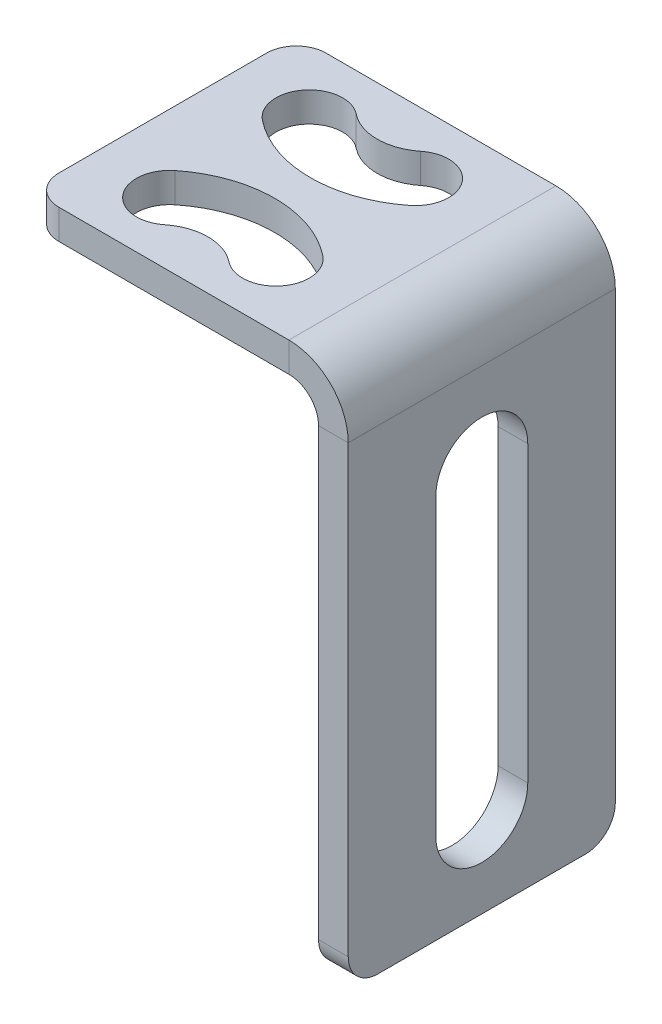
ISO-10303-21;
HEADER;
FILE_DESCRIPTION(('STEP AP214'),'2;1');
FILE_NAME('part.step','',(''),(''),'','','');
FILE_SCHEMA(('AUTOMOTIVE_DESIGN { 1 0 10303 214 1 1 1 1 }'));
ENDSEC;
DATA;
#1=APPLICATION_CONTEXT('core data for automotive mechanical design processes');
#2=APPLICATION_PROTOCOL_DEFINITION('international standard','automotive_design',2000,#1);
#3=PRODUCT_CONTEXT('',#1,'mechanical');
#4=PRODUCT('Part','Part','',(#3));
#5=PRODUCT_RELATED_PRODUCT_CATEGORY('part','',(#4));
#6=PRODUCT_DEFINITION_FORMATION('','',#4);
#7=PRODUCT_DEFINITION_CONTEXT('part definition',#1,'design');
#8=PRODUCT_DEFINITION('design','',#6,#7);
#9=PRODUCT_DEFINITION_SHAPE('','',#8);
#10=(LENGTH_UNIT() NAMED_UNIT(*) SI_UNIT(.MILLI.,.METRE.));
#11=(NAMED_UNIT(*) PLANE_ANGLE_UNIT() SI_UNIT($,.RADIAN.));
#12=(NAMED_UNIT(*) SI_UNIT($,.STERADIAN.) SOLID_ANGLE_UNIT());
#13=UNCERTAINTY_MEASURE_WITH_UNIT(LENGTH_MEASURE(1.E-05),#10,'distance_accuracy_value','');
#14=(GEOMETRIC_REPRESENTATION_CONTEXT(3) GLOBAL_UNCERTAINTY_ASSIGNED_CONTEXT((#13)) GLOBAL_UNIT_ASSIGNED_CONTEXT((#10,
#11,#12)) REPRESENTATION_CONTEXT('',''));
#15=CARTESIAN_POINT('',(0.,0.,0.));
#16=DIRECTION('',(0.,0.,1.));
#17=DIRECTION('',(1.,0.,0.));
#18=AXIS2_PLACEMENT_3D('',#15,#16,#17);
#19=CARTESIAN_POINT('',(0.,-2.,59.9314917454649));
#20=DIRECTION('',(0.,-1.,0.));
#21=DIRECTION('',(1.,0.,0.));
#22=AXIS2_PLACEMENT_3D('',#19,#20,#21);
#23=PLANE('',#22);
#24=CARTESIAN_POINT('',(-12.75,-2.,-0.189186414028294));
#25=DIRECTION('',(0.,-1.,0.));
#26=DIRECTION('',(1.,0.,0.));
#27=AXIS2_PLACEMENT_3D('',#24,#25,#26);
#28=CIRCLE('',#27,3.48876464580081);
#29=CARTESIAN_POINT('',(-14.9233481643761,-2.,2.53992269155772));
#30=VERTEX_POINT('',#29);
#31=CARTESIAN_POINT('',(-10.5766518356239,-2.,2.53992269155772));
#32=VERTEX_POINT('',#31);
#33=EDGE_CURVE('E364',#30,#32,#28,.F.);
#34=ORIENTED_EDGE('',*,*,#33,.F.);
#35=CARTESIAN_POINT('',(-16.325,-2.,4.29999999999967));
#36=DIRECTION('',(0.,-1.,0.));
#37=DIRECTION('',(1.,0.,0.));
#38=AXIS2_PLACEMENT_3D('',#35,#36,#37);
#39=CIRCLE('',#38,2.25);
#40=CARTESIAN_POINT('',(-17.7266518356239,-2.,6.06007730844163));
#41=VERTEX_POINT('',#40);
#42=EDGE_CURVE('E239',#30,#41,#39,.F.);
#43=ORIENTED_EDGE('',*,*,#42,.T.);
#44=CARTESIAN_POINT('',(-12.75,-2.,-0.189186414028294));
#45=DIRECTION('',(0.,-1.,0.));
#46=DIRECTION('',(1.,0.,0.));
#47=AXIS2_PLACEMENT_3D('',#44,#45,#46);
#48=CIRCLE('',#47,7.98876464580081);
#49=CARTESIAN_POINT('',(-7.77334816437615,-2.,6.06007730844163));
#50=VERTEX_POINT('',#49);
#51=EDGE_CURVE('E373',#50,#41,#48,.T.);
#52=ORIENTED_EDGE('',*,*,#51,.F.);
#53=CARTESIAN_POINT('',(-9.175,-2.,4.29999999999967));
#54=DIRECTION('',(0.,-1.,0.));
#55=DIRECTION('',(1.,0.,0.));
#56=AXIS2_PLACEMENT_3D('',#53,#54,#55);
#57=CIRCLE('',#56,2.25);
#58=EDGE_CURVE('E235',#50,#32,#57,.F.);
#59=ORIENTED_EDGE('',*,*,#58,.T.);
#60=EDGE_LOOP('',(#34,#43,#52,#59));
#61=FACE_BOUND('',#60,.T.);
#62=DIRECTION('',(1.,0.,0.));
#63=VECTOR('',#62,1.);
#64=CARTESIAN_POINT('',(0.,-2.,17.9999999999999));
#65=LINE('',#64,#63);
#66=CARTESIAN_POINT('',(-19.5,-2.,17.9999999999999));
#67=VERTEX_POINT('',#66);
#68=CARTESIAN_POINT('',(-4.,-2.,17.9999999999999));
#69=VERTEX_POINT('',#68);
#70=EDGE_CURVE('E257',#67,#69,#65,.T.);
#71=ORIENTED_EDGE('',*,*,#70,.F.);
#72=CARTESIAN_POINT('',(-19.5,-2.,15.9999999999999));
#73=DIRECTION('',(0.,-1.,0.));
#74=DIRECTION('',(1.,0.,0.));
#75=AXIS2_PLACEMENT_3D('',#72,#73,#74);
#76=CIRCLE('',#75,2.);
#77=CARTESIAN_POINT('',(-21.5,-2.,15.9999999999999));
#78=VERTEX_POINT('',#77);
#79=EDGE_CURVE('E336',#67,#78,#76,.T.);
#80=ORIENTED_EDGE('',*,*,#79,.T.);
#81=DIRECTION('',(0.,0.,-1.));
#82=VECTOR('',#81,1.);
#83=CARTESIAN_POINT('',(-21.5,-2.,59.9314917454649));
#84=LINE('',#83,#82);
#85=CARTESIAN_POINT('',(-21.5,-2.,2.));
#86=VERTEX_POINT('',#85);
#87=EDGE_CURVE('E259',#78,#86,#84,.T.);
#88=ORIENTED_EDGE('',*,*,#87,.T.);
#89=CARTESIAN_POINT('',(-19.5,-2.,2.));
#90=DIRECTION('',(0.,-1.,0.));
#91=DIRECTION('',(1.,0.,0.));
#92=AXIS2_PLACEMENT_3D('',#89,#90,#91);
#93=CIRCLE('',#92,2.);
#94=CARTESIAN_POINT('',(-19.5,-2.,0.));
#95=VERTEX_POINT('',#94);
#96=EDGE_CURVE('E334',#86,#95,#93,.T.);
#97=ORIENTED_EDGE('',*,*,#96,.T.);
#98=DIRECTION('',(-1.,0.,0.));
#99=VECTOR('',#98,1.);
#100=CARTESIAN_POINT('',(0.,-2.,0.));
#101=LINE('',#100,#99);
#102=CARTESIAN_POINT('',(-4.,-2.,0.));
#103=VERTEX_POINT('',#102);
#104=EDGE_CURVE('E262',#103,#95,#101,.T.);
#105=ORIENTED_EDGE('',*,*,#104,.F.);
#106=DIRECTION('',(0.,0.,-1.));
#107=VECTOR('',#106,1.);
#108=CARTESIAN_POINT('',(-4.,-2.,17.9999999999999));
#109=LINE('',#108,#107);
#110=EDGE_CURVE('E268',#103,#69,#109,.F.);
#111=ORIENTED_EDGE('',*,*,#110,.T.);
#112=EDGE_LOOP('',(#71,#80,#88,#97,#105,#111));
#113=FACE_BOUND('',#112,.T.);
#114=CARTESIAN_POINT('',(-9.175,-2.,13.7000000000002));
#115=DIRECTION('',(0.,-1.,0.));
#116=DIRECTION('',(1.,0.,0.));
#117=AXIS2_PLACEMENT_3D('',#114,#115,#116);
#118=CIRCLE('',#117,2.25);
#119=CARTESIAN_POINT('',(-7.77334816437614,-2.,11.9399226915583));
#120=VERTEX_POINT('',#119);
#121=CARTESIAN_POINT('',(-10.5766518356239,-2.,15.4600773084422));
#122=VERTEX_POINT('',#121);
#123=EDGE_CURVE('E197',#120,#122,#118,.T.);
#124=ORIENTED_EDGE('',*,*,#123,.F.);
#125=CARTESIAN_POINT('',(-12.75,-2.,18.1891864140282));
#126=DIRECTION('',(0.,-1.,0.));
#127=DIRECTION('',(1.,0.,0.));
#128=AXIS2_PLACEMENT_3D('',#125,#126,#127);
#129=CIRCLE('',#128,7.98876464580081);
#130=CARTESIAN_POINT('',(-17.7266518356239,-2.,11.9399226915583));
#131=VERTEX_POINT('',#130);
#132=EDGE_CURVE('E30',#120,#131,#129,.F.);
#133=ORIENTED_EDGE('',*,*,#132,.T.);
#134=CARTESIAN_POINT('',(-16.325,-2.,13.7000000000002));
#135=DIRECTION('',(0.,-1.,0.));
#136=DIRECTION('',(1.,0.,0.));
#137=AXIS2_PLACEMENT_3D('',#134,#135,#136);
#138=CIRCLE('',#137,2.25);
#139=CARTESIAN_POINT('',(-14.9233481643761,-2.,15.4600773084422));
#140=VERTEX_POINT('',#139);
#141=EDGE_CURVE('E196',#140,#131,#138,.T.);
#142=ORIENTED_EDGE('',*,*,#141,.F.);
#143=CARTESIAN_POINT('',(-12.75,-2.,18.1891864140282));
#144=DIRECTION('',(0.,-1.,0.));
#145=DIRECTION('',(1.,0.,0.));
#146=AXIS2_PLACEMENT_3D('',#143,#144,#145);
#147=CIRCLE('',#146,3.48876464580081);
#148=EDGE_CURVE('E188',#140,#122,#147,.T.);
#149=ORIENTED_EDGE('',*,*,#148,.T.);
#150=EDGE_LOOP('',(#124,#133,#142,#149));
#151=FACE_BOUND('',#150,.T.);
#152=ADVANCED_FACE('F16',(#61,#113,#151),#23,.T.);
#153=CARTESIAN_POINT('',(0.,0.,59.9314917454649));
#154=DIRECTION('',(0.,-1.,0.));
#155=DIRECTION('',(1.,0.,0.));
#156=AXIS2_PLACEMENT_3D('',#153,#154,#155);
#157=PLANE('',#156);
#158=CARTESIAN_POINT('',(-16.325,0.,4.29999999999967));
#159=DIRECTION('',(0.,1.,0.));
#160=DIRECTION('',(-1.,0.,0.));
#161=AXIS2_PLACEMENT_3D('',#158,#159,#160);
#162=CIRCLE('',#161,2.25);
#163=CARTESIAN_POINT('',(-14.9233481643761,0.,2.53992269155772));
#164=VERTEX_POINT('',#163);
#165=CARTESIAN_POINT('',(-17.7266518356239,0.,6.06007730844163));
#166=VERTEX_POINT('',#165);
#167=EDGE_CURVE('E242',#164,#166,#162,.T.);
#168=ORIENTED_EDGE('',*,*,#167,.F.);
#169=CARTESIAN_POINT('',(-12.75,0.,-0.189186414028294));
#170=DIRECTION('',(0.,-1.,0.));
#171=DIRECTION('',(-1.,0.,0.));
#172=AXIS2_PLACEMENT_3D('',#169,#170,#171);
#173=CIRCLE('',#172,3.48876464580081);
#174=CARTESIAN_POINT('',(-10.5766518356239,0.,2.53992269155772));
#175=VERTEX_POINT('',#174);
#176=EDGE_CURVE('E358',#175,#164,#173,.T.);
#177=ORIENTED_EDGE('',*,*,#176,.F.);
#178=CARTESIAN_POINT('',(-9.175,0.,4.29999999999967));
#179=DIRECTION('',(0.,1.,0.));
#180=DIRECTION('',(-1.,0.,0.));
#181=AXIS2_PLACEMENT_3D('',#178,#179,#180);
#182=CIRCLE('',#181,2.25);
#183=CARTESIAN_POINT('',(-7.77334816437615,0.,6.06007730844163));
#184=VERTEX_POINT('',#183);
#185=EDGE_CURVE('E236',#184,#175,#182,.T.);
#186=ORIENTED_EDGE('',*,*,#185,.F.);
#187=CARTESIAN_POINT('',(-12.75,0.,-0.189186414028294));
#188=DIRECTION('',(0.,1.,0.));
#189=DIRECTION('',(-1.,0.,0.));
#190=AXIS2_PLACEMENT_3D('',#187,#188,#189);
#191=CIRCLE('',#190,7.98876464580081);
#192=EDGE_CURVE('E353',#166,#184,#191,.T.);
#193=ORIENTED_EDGE('',*,*,#192,.F.);
#194=EDGE_LOOP('',(#168,#177,#186,#193));
#195=FACE_BOUND('',#194,.T.);
#196=DIRECTION('',(0.,0.,1.));
#197=VECTOR('',#196,1.);
#198=CARTESIAN_POINT('',(-21.5,0.,59.9314917454649));
#199=LINE('',#198,#197);
#200=CARTESIAN_POINT('',(-21.5,0.,15.9999999999999));
#201=VERTEX_POINT('',#200);
#202=CARTESIAN_POINT('',(-21.5,0.,2.));
#203=VERTEX_POINT('',#202);
#204=EDGE_CURVE('E286',#201,#203,#199,.F.);
#205=ORIENTED_EDGE('',*,*,#204,.F.);
#206=CARTESIAN_POINT('',(-19.5,0.,15.9999999999999));
#207=DIRECTION('',(0.,-1.,0.));
#208=DIRECTION('',(1.,0.,0.));
#209=AXIS2_PLACEMENT_3D('',#206,#207,#208);
#210=CIRCLE('',#209,2.);
#211=CARTESIAN_POINT('',(-19.5,0.,17.9999999999999));
#212=VERTEX_POINT('',#211);
#213=EDGE_CURVE('E345',#201,#212,#210,.F.);
#214=ORIENTED_EDGE('',*,*,#213,.T.);
#215=DIRECTION('',(1.,0.,0.));
#216=VECTOR('',#215,1.);
#217=CARTESIAN_POINT('',(0.,0.,17.9999999999999));
#218=LINE('',#217,#216);
#219=CARTESIAN_POINT('',(-4.,0.,17.9999999999999));
#220=VERTEX_POINT('',#219);
#221=EDGE_CURVE('E289',#212,#220,#218,.T.);
#222=ORIENTED_EDGE('',*,*,#221,.T.);
#223=DIRECTION('',(0.,0.,1.));
#224=VECTOR('',#223,1.);
#225=CARTESIAN_POINT('',(-4.,0.,59.9314917454649));
#226=LINE('',#225,#224);
#227=CARTESIAN_POINT('',(-4.,0.,0.));
#228=VERTEX_POINT('',#227);
#229=EDGE_CURVE('E275',#228,#220,#226,.T.);
#230=ORIENTED_EDGE('',*,*,#229,.F.);
#231=DIRECTION('',(1.,0.,0.));
#232=VECTOR('',#231,1.);
#233=CARTESIAN_POINT('',(0.,0.,0.));
#234=LINE('',#233,#232);
#235=CARTESIAN_POINT('',(-19.5,0.,0.));
#236=VERTEX_POINT('',#235);
#237=EDGE_CURVE('E283',#228,#236,#234,.F.);
#238=ORIENTED_EDGE('',*,*,#237,.T.);
#239=CARTESIAN_POINT('',(-19.5,0.,2.));
#240=DIRECTION('',(0.,-1.,0.));
#241=DIRECTION('',(1.,0.,0.));
#242=AXIS2_PLACEMENT_3D('',#239,#240,#241);
#243=CIRCLE('',#242,2.);
#244=EDGE_CURVE('E343',#236,#203,#243,.F.);
#245=ORIENTED_EDGE('',*,*,#244,.T.);
#246=EDGE_LOOP('',(#205,#214,#222,#230,#238,#245));
#247=FACE_BOUND('',#246,.T.);
#248=CARTESIAN_POINT('',(-12.75,0.,18.1891864140282));
#249=DIRECTION('',(0.,-1.,0.));
#250=DIRECTION('',(-1.,0.,0.));
#251=AXIS2_PLACEMENT_3D('',#248,#249,#250);
#252=CIRCLE('',#251,7.98876464580081);
#253=CARTESIAN_POINT('',(-17.7266518356239,0.,11.9399226915583));
#254=VERTEX_POINT('',#253);
#255=CARTESIAN_POINT('',(-7.77334816437615,0.,11.9399226915583));
#256=VERTEX_POINT('',#255);
#257=EDGE_CURVE('E182',#254,#256,#252,.T.);
#258=ORIENTED_EDGE('',*,*,#257,.T.);
#259=CARTESIAN_POINT('',(-9.175,0.,13.7000000000002));
#260=DIRECTION('',(0.,-1.,0.));
#261=DIRECTION('',(-1.,0.,0.));
#262=AXIS2_PLACEMENT_3D('',#259,#260,#261);
#263=CIRCLE('',#262,2.25);
#264=CARTESIAN_POINT('',(-10.5766518356239,0.,15.4600773084422));
#265=VERTEX_POINT('',#264);
#266=EDGE_CURVE('E181',#256,#265,#263,.T.);
#267=ORIENTED_EDGE('',*,*,#266,.T.);
#268=CARTESIAN_POINT('',(-12.75,0.,18.1891864140282));
#269=DIRECTION('',(0.,1.,0.));
#270=DIRECTION('',(-1.,0.,0.));
#271=AXIS2_PLACEMENT_3D('',#268,#269,#270);
#272=CIRCLE('',#271,3.48876464580081);
#273=CARTESIAN_POINT('',(-14.9233481643761,0.,15.4600773084422));
#274=VERTEX_POINT('',#273);
#275=EDGE_CURVE('E38',#265,#274,#272,.T.);
#276=ORIENTED_EDGE('',*,*,#275,.T.);
#277=CARTESIAN_POINT('',(-16.325,0.,13.7000000000002));
#278=DIRECTION('',(0.,-1.,0.));
#279=DIRECTION('',(-1.,0.,0.));
#280=AXIS2_PLACEMENT_3D('',#277,#278,#279);
#281=CIRCLE('',#280,2.25);
#282=EDGE_CURVE('E179',#274,#254,#281,.T.);
#283=ORIENTED_EDGE('',*,*,#282,.T.);
#284=EDGE_LOOP('',(#258,#267,#276,#283));
#285=FACE_BOUND('',#284,.T.);
#286=ADVANCED_FACE('F177',(#195,#247,#285),#157,.F.);
#287=CARTESIAN_POINT('',(-16.325,-36.001,13.7000000000002));
#288=DIRECTION('',(0.,1.,0.));
#289=DIRECTION('',(-1.,0.,0.));
#290=AXIS2_PLACEMENT_3D('',#287,#288,#289);
#291=CYLINDRICAL_SURFACE('',#290,2.25);
#292=ORIENTED_EDGE('',*,*,#141,.T.);
#293=DIRECTION('',(0.,1.,0.));
#294=VECTOR('',#293,1.);
#295=CARTESIAN_POINT('',(-17.7266518356239,-36.,11.9399226915583));
#296=LINE('',#295,#294);
#297=EDGE_CURVE('E192',#131,#254,#296,.T.);
#298=ORIENTED_EDGE('',*,*,#297,.T.);
#299=ORIENTED_EDGE('',*,*,#282,.F.);
#300=DIRECTION('',(0.,1.,0.));
#301=VECTOR('',#300,1.);
#302=CARTESIAN_POINT('',(-14.9233481643761,-36.,15.4600773084422));
#303=LINE('',#302,#301);
#304=EDGE_CURVE('E185',#140,#274,#303,.T.);
#305=ORIENTED_EDGE('',*,*,#304,.F.);
#306=EDGE_LOOP('',(#292,#298,#299,#305));
#307=FACE_BOUND('',#306,.T.);
#308=ADVANCED_FACE('F195',(#307),#291,.F.);
#309=CARTESIAN_POINT('',(-9.175,-36.001,13.7000000000002));
#310=DIRECTION('',(0.,1.,0.));
#311=DIRECTION('',(-1.,0.,0.));
#312=AXIS2_PLACEMENT_3D('',#309,#310,#311);
#313=CYLINDRICAL_SURFACE('',#312,2.25);
#314=DIRECTION('',(0.,1.,0.));
#315=VECTOR('',#314,1.);
#316=CARTESIAN_POINT('',(-7.77334816437614,-18.,11.9399226915583));
#317=LINE('',#316,#315);
#318=EDGE_CURVE('E10',#120,#256,#317,.T.);
#319=ORIENTED_EDGE('',*,*,#318,.F.);
#320=ORIENTED_EDGE('',*,*,#123,.T.);
#321=DIRECTION('',(0.,1.,0.));
#322=VECTOR('',#321,1.);
#323=CARTESIAN_POINT('',(-10.5766518356239,-18.,15.4600773084422));
#324=LINE('',#323,#322);
#325=EDGE_CURVE('E24',#122,#265,#324,.T.);
#326=ORIENTED_EDGE('',*,*,#325,.T.);
#327=ORIENTED_EDGE('',*,*,#266,.F.);
#328=EDGE_LOOP('',(#319,#320,#326,#327));
#329=FACE_BOUND('',#328,.T.);
#330=ADVANCED_FACE('F349',(#329),#313,.F.);
#331=CARTESIAN_POINT('',(-16.325,-36.001,4.29999999999967));
#332=DIRECTION('',(0.,1.,0.));
#333=DIRECTION('',(-1.,0.,0.));
#334=AXIS2_PLACEMENT_3D('',#331,#332,#333);
#335=CYLINDRICAL_SURFACE('',#334,2.25);
#336=ORIENTED_EDGE('',*,*,#42,.F.);
#337=DIRECTION('',(0.,1.,0.));
#338=VECTOR('',#337,1.);
#339=CARTESIAN_POINT('',(-14.9233481643761,-36.,2.53992269155772));
#340=LINE('',#339,#338);
#341=EDGE_CURVE('E361',#30,#164,#340,.T.);
#342=ORIENTED_EDGE('',*,*,#341,.T.);
#343=ORIENTED_EDGE('',*,*,#167,.T.);
#344=DIRECTION('',(0.,1.,0.));
#345=VECTOR('',#344,1.);
#346=CARTESIAN_POINT('',(-17.7266518356239,-36.,6.06007730844163));
#347=LINE('',#346,#345);
#348=EDGE_CURVE('E360',#41,#166,#347,.T.);
#349=ORIENTED_EDGE('',*,*,#348,.F.);
#350=EDGE_LOOP('',(#336,#342,#343,#349));
#351=FACE_BOUND('',#350,.T.);
#352=ADVANCED_FACE('F383',(#351),#335,.F.);
#353=CARTESIAN_POINT('',(-9.175,-36.001,4.29999999999967));
#354=DIRECTION('',(0.,1.,0.));
#355=DIRECTION('',(-1.,0.,0.));
#356=AXIS2_PLACEMENT_3D('',#353,#354,#355);
#357=CYLINDRICAL_SURFACE('',#356,2.25);
#358=DIRECTION('',(0.,1.,0.));
#359=VECTOR('',#358,1.);
#360=CARTESIAN_POINT('',(-10.5766518356239,-36.,2.53992269155772));
#361=LINE('',#360,#359);
#362=EDGE_CURVE('E365',#32,#175,#361,.T.);
#363=ORIENTED_EDGE('',*,*,#362,.F.);
#364=ORIENTED_EDGE('',*,*,#58,.F.);
#365=DIRECTION('',(0.,1.,0.));
#366=VECTOR('',#365,1.);
#367=CARTESIAN_POINT('',(-7.77334816437614,-36.,6.06007730844163));
#368=LINE('',#367,#366);
#369=EDGE_CURVE('E368',#50,#184,#368,.T.);
#370=ORIENTED_EDGE('',*,*,#369,.T.);
#371=ORIENTED_EDGE('',*,*,#185,.T.);
#372=EDGE_LOOP('',(#363,#364,#370,#371));
#373=FACE_BOUND('',#372,.T.);
#374=ADVANCED_FACE('F391',(#373),#357,.F.);
#375=CARTESIAN_POINT('',(-2.,0.,0.));
#376=DIRECTION('',(0.,0.,1.));
#377=DIRECTION('',(0.,1.,0.));
#378=AXIS2_PLACEMENT_3D('',#375,#376,#377);
#379=PLANE('',#378);
#380=DIRECTION('',(0.,-1.,0.));
#381=VECTOR('',#380,1.);
#382=CARTESIAN_POINT('',(0.,0.,0.));
#383=LINE('',#382,#381);
#384=CARTESIAN_POINT('',(0.,-34.,0.));
#385=VERTEX_POINT('',#384);
#386=CARTESIAN_POINT('',(0.,-4.,0.));
#387=VERTEX_POINT('',#386);
#388=EDGE_CURVE('E298',#385,#387,#383,.F.);
#389=ORIENTED_EDGE('',*,*,#388,.F.);
#390=DIRECTION('',(1.,0.,0.));
#391=VECTOR('',#390,1.);
#392=CARTESIAN_POINT('',(-2.,-34.,0.));
#393=LINE('',#392,#391);
#394=CARTESIAN_POINT('',(-2.,-34.,0.));
#395=VERTEX_POINT('',#394);
#396=EDGE_CURVE('E312',#385,#395,#393,.F.);
#397=ORIENTED_EDGE('',*,*,#396,.T.);
#398=DIRECTION('',(0.,1.,0.));
#399=VECTOR('',#398,1.);
#400=CARTESIAN_POINT('',(-2.,0.,0.));
#401=LINE('',#400,#399);
#402=CARTESIAN_POINT('',(-2.,-4.,0.));
#403=VERTEX_POINT('',#402);
#404=EDGE_CURVE('E251',#395,#403,#401,.T.);
#405=ORIENTED_EDGE('',*,*,#404,.T.);
#406=DIRECTION('',(-1.,0.,0.));
#407=VECTOR('',#406,1.);
#408=CARTESIAN_POINT('',(-2.,-4.,0.));
#409=LINE('',#408,#407);
#410=EDGE_CURVE('E309',#387,#403,#409,.T.);
#411=ORIENTED_EDGE('',*,*,#410,.F.);
#412=EDGE_LOOP('',(#389,#397,#405,#411));
#413=FACE_BOUND('',#412,.T.);
#414=ADVANCED_FACE('F439',(#413),#379,.F.);
#415=CARTESIAN_POINT('',(-2.,-36.,59.9314917454649));
#416=DIRECTION('',(0.,1.,0.));
#417=DIRECTION('',(0.,0.,-1.));
#418=AXIS2_PLACEMENT_3D('',#415,#416,#417);
#419=PLANE('',#418);
#420=DIRECTION('',(0.,0.,-1.));
#421=VECTOR('',#420,1.);
#422=CARTESIAN_POINT('',(-2.,-36.,59.9314917454649));
#423=LINE('',#422,#421);
#424=CARTESIAN_POINT('',(-2.,-36.,15.9999999999999));
#425=VERTEX_POINT('',#424);
#426=CARTESIAN_POINT('',(-2.,-36.,2.));
#427=VERTEX_POINT('',#426);
#428=EDGE_CURVE('E254',#425,#427,#423,.T.);
#429=ORIENTED_EDGE('',*,*,#428,.T.);
#430=DIRECTION('',(1.,0.,0.));
#431=VECTOR('',#430,1.);
#432=CARTESIAN_POINT('',(-2.,-36.,2.));
#433=LINE('',#432,#431);
#434=CARTESIAN_POINT('',(0.,-36.,2.));
#435=VERTEX_POINT('',#434);
#436=EDGE_CURVE('E323',#427,#435,#433,.T.);
#437=ORIENTED_EDGE('',*,*,#436,.T.);
#438=DIRECTION('',(0.,0.,1.));
#439=VECTOR('',#438,1.);
#440=CARTESIAN_POINT('',(0.,-36.,59.9314917454649));
#441=LINE('',#440,#439);
#442=CARTESIAN_POINT('',(0.,-36.,15.9999999999999));
#443=VERTEX_POINT('',#442);
#444=EDGE_CURVE('E291',#443,#435,#441,.F.);
#445=ORIENTED_EDGE('',*,*,#444,.F.);
#446=DIRECTION('',(1.,0.,0.));
#447=VECTOR('',#446,1.);
#448=CARTESIAN_POINT('',(-2.,-36.,15.9999999999999));
#449=LINE('',#448,#447);
#450=EDGE_CURVE('E320',#443,#425,#449,.F.);
#451=ORIENTED_EDGE('',*,*,#450,.T.);
#452=EDGE_LOOP('',(#429,#437,#445,#451));
#453=FACE_BOUND('',#452,.T.);
#454=ADVANCED_FACE('F461',(#453),#419,.F.);
#455=CARTESIAN_POINT('',(-2.,0.,17.9999999999999));
#456=DIRECTION('',(0.,0.,-1.));
#457=DIRECTION('',(0.,-1.,0.));
#458=AXIS2_PLACEMENT_3D('',#455,#456,#457);
#459=PLANE('',#458);
#460=DIRECTION('',(0.,-1.,0.));
#461=VECTOR('',#460,1.);
#462=CARTESIAN_POINT('',(-2.,0.,17.9999999999999));
#463=LINE('',#462,#461);
#464=CARTESIAN_POINT('',(-2.,-4.,17.9999999999999));
#465=VERTEX_POINT('',#464);
#466=CARTESIAN_POINT('',(-2.,-34.,17.9999999999999));
#467=VERTEX_POINT('',#466);
#468=EDGE_CURVE('E248',#465,#467,#463,.T.);
#469=ORIENTED_EDGE('',*,*,#468,.T.);
#470=DIRECTION('',(1.,0.,0.));
#471=VECTOR('',#470,1.);
#472=CARTESIAN_POINT('',(-2.,-34.,17.9999999999999));
#473=LINE('',#472,#471);
#474=CARTESIAN_POINT('',(0.,-34.,17.9999999999999));
#475=VERTEX_POINT('',#474);
#476=EDGE_CURVE('E329',#467,#475,#473,.T.);
#477=ORIENTED_EDGE('',*,*,#476,.T.);
#478=DIRECTION('',(0.,-1.,0.));
#479=VECTOR('',#478,1.);
#480=CARTESIAN_POINT('',(0.,0.,17.9999999999999));
#481=LINE('',#480,#479);
#482=CARTESIAN_POINT('',(0.,-4.,17.9999999999999));
#483=VERTEX_POINT('',#482);
#484=EDGE_CURVE('E295',#483,#475,#481,.T.);
#485=ORIENTED_EDGE('',*,*,#484,.F.);
#486=DIRECTION('',(-1.,0.,0.));
#487=VECTOR('',#486,1.);
#488=CARTESIAN_POINT('',(-2.,-4.,17.9999999999999));
#489=LINE('',#488,#487);
#490=EDGE_CURVE('E307',#483,#465,#489,.T.);
#491=ORIENTED_EDGE('',*,*,#490,.T.);
#492=EDGE_LOOP('',(#469,#477,#485,#491));
#493=FACE_BOUND('',#492,.T.);
#494=ADVANCED_FACE('F456',(#493),#459,.F.);
#495=CARTESIAN_POINT('',(-4.,-4.,17.9999999999999));
#496=DIRECTION('',(0.,0.,1.));
#497=DIRECTION('',(1.,0.,0.));
#498=AXIS2_PLACEMENT_3D('',#495,#496,#497);
#499=PLANE('',#498);
#500=ORIENTED_EDGE('',*,*,#490,.F.);
#501=CARTESIAN_POINT('',(-4.,-4.,17.9999999999999));
#502=DIRECTION('',(0.,0.,1.));
#503=DIRECTION('',(1.,0.,0.));
#504=AXIS2_PLACEMENT_3D('',#501,#502,#503);
#505=CIRCLE('',#504,4.);
#506=EDGE_CURVE('E292',#483,#220,#505,.T.);
#507=ORIENTED_EDGE('',*,*,#506,.T.);
#508=DIRECTION('',(0.,-1.,0.));
#509=VECTOR('',#508,1.);
#510=CARTESIAN_POINT('',(-4.,-2.,17.9999999999999));
#511=LINE('',#510,#509);
#512=EDGE_CURVE('E304',#220,#69,#511,.T.);
#513=ORIENTED_EDGE('',*,*,#512,.T.);
#514=CARTESIAN_POINT('',(-4.,-4.,17.9999999999999));
#515=DIRECTION('',(0.,0.,-1.));
#516=DIRECTION('',(-1.,0.,0.));
#517=AXIS2_PLACEMENT_3D('',#514,#515,#516);
#518=CIRCLE('',#517,2.);
#519=EDGE_CURVE('E252',#465,#69,#518,.F.);
#520=ORIENTED_EDGE('',*,*,#519,.F.);
#521=EDGE_LOOP('',(#500,#507,#513,#520));
#522=FACE_BOUND('',#521,.T.);
#523=ADVANCED_FACE('F420',(#522),#499,.T.);
#524=CARTESIAN_POINT('',(0.,-2.,17.9999999999999));
#525=DIRECTION('',(0.,0.,-1.));
#526=DIRECTION('',(1.,0.,0.));
#527=AXIS2_PLACEMENT_3D('',#524,#525,#526);
#528=PLANE('',#527);
#529=ORIENTED_EDGE('',*,*,#221,.F.);
#530=DIRECTION('',(0.,-1.,0.));
#531=VECTOR('',#530,1.);
#532=CARTESIAN_POINT('',(-19.5,-2.,17.9999999999999));
#533=LINE('',#532,#531);
#534=EDGE_CURVE('E331',#212,#67,#533,.T.);
#535=ORIENTED_EDGE('',*,*,#534,.T.);
#536=ORIENTED_EDGE('',*,*,#70,.T.);
#537=ORIENTED_EDGE('',*,*,#512,.F.);
#538=EDGE_LOOP('',(#529,#535,#536,#537));
#539=FACE_BOUND('',#538,.T.);
#540=ADVANCED_FACE('F409',(#539),#528,.F.);
#541=CARTESIAN_POINT('',(-21.5,-2.,59.9314917454649));
#542=DIRECTION('',(-1.,0.,0.));
#543=DIRECTION('',(0.,0.,-1.));
#544=AXIS2_PLACEMENT_3D('',#541,#542,#543);
#545=PLANE('',#544);
#546=ORIENTED_EDGE('',*,*,#87,.F.);
#547=DIRECTION('',(0.,1.,0.));
#548=VECTOR('',#547,1.);
#549=CARTESIAN_POINT('',(-21.5,-2.,15.9999999999999));
#550=LINE('',#549,#548);
#551=EDGE_CURVE('E341',#78,#201,#550,.T.);
#552=ORIENTED_EDGE('',*,*,#551,.T.);
#553=ORIENTED_EDGE('',*,*,#204,.T.);
#554=DIRECTION('',(0.,1.,0.));
#555=VECTOR('',#554,1.);
#556=CARTESIAN_POINT('',(-21.5,-2.,2.));
#557=LINE('',#556,#555);
#558=EDGE_CURVE('E338',#203,#86,#557,.F.);
#559=ORIENTED_EDGE('',*,*,#558,.T.);
#560=EDGE_LOOP('',(#546,#552,#553,#559));
#561=FACE_BOUND('',#560,.T.);
#562=ADVANCED_FACE('F432',(#561),#545,.T.);
#563=CARTESIAN_POINT('',(0.,-2.,0.));
#564=DIRECTION('',(0.,0.,1.));
#565=DIRECTION('',(-1.,0.,0.));
#566=AXIS2_PLACEMENT_3D('',#563,#564,#565);
#567=PLANE('',#566);
#568=ORIENTED_EDGE('',*,*,#104,.T.);
#569=DIRECTION('',(0.,-1.,0.));
#570=VECTOR('',#569,1.);
#571=CARTESIAN_POINT('',(-19.5,-2.,0.));
#572=LINE('',#571,#570);
#573=EDGE_CURVE('E347',#95,#236,#572,.F.);
#574=ORIENTED_EDGE('',*,*,#573,.T.);
#575=ORIENTED_EDGE('',*,*,#237,.F.);
#576=DIRECTION('',(0.,-1.,0.));
#577=VECTOR('',#576,1.);
#578=CARTESIAN_POINT('',(-4.,-2.,0.));
#579=LINE('',#578,#577);
#580=EDGE_CURVE('E271',#228,#103,#579,.T.);
#581=ORIENTED_EDGE('',*,*,#580,.T.);
#582=EDGE_LOOP('',(#568,#574,#575,#581));
#583=FACE_BOUND('',#582,.T.);
#584=ADVANCED_FACE('F433',(#583),#567,.F.);
#585=CARTESIAN_POINT('',(-4.,-4.,0.));
#586=DIRECTION('',(0.,0.,-1.));
#587=DIRECTION('',(-1.,0.,0.));
#588=AXIS2_PLACEMENT_3D('',#585,#586,#587);
#589=PLANE('',#588);
#590=CARTESIAN_POINT('',(-4.,-4.,0.));
#591=DIRECTION('',(0.,0.,1.));
#592=DIRECTION('',(1.,0.,0.));
#593=AXIS2_PLACEMENT_3D('',#590,#591,#592);
#594=CIRCLE('',#593,4.);
#595=EDGE_CURVE('E245',#228,#387,#594,.F.);
#596=ORIENTED_EDGE('',*,*,#595,.T.);
#597=ORIENTED_EDGE('',*,*,#410,.T.);
#598=CARTESIAN_POINT('',(-4.,-4.,0.));
#599=DIRECTION('',(0.,0.,1.));
#600=DIRECTION('',(1.,0.,0.));
#601=AXIS2_PLACEMENT_3D('',#598,#599,#600);
#602=CIRCLE('',#601,2.);
#603=EDGE_CURVE('E272',#103,#403,#602,.F.);
#604=ORIENTED_EDGE('',*,*,#603,.F.);
#605=ORIENTED_EDGE('',*,*,#580,.F.);
#606=EDGE_LOOP('',(#596,#597,#604,#605));
#607=FACE_BOUND('',#606,.T.);
#608=ADVANCED_FACE('F435',(#607),#589,.T.);
#609=CARTESIAN_POINT('',(-2.,0.,59.9314917454649));
#610=DIRECTION('',(-1.,0.,0.));
#611=DIRECTION('',(0.,-1.,0.));
#612=AXIS2_PLACEMENT_3D('',#609,#610,#611);
#613=PLANE('',#612);
#614=CARTESIAN_POINT('',(-2.,-29.9,8.99999999999995));
#615=DIRECTION('',(-1.,0.,0.));
#616=DIRECTION('',(0.,-1.,0.));
#617=AXIS2_PLACEMENT_3D('',#614,#615,#616);
#618=CIRCLE('',#617,3.1);
#619=CARTESIAN_POINT('',(-2.,-29.9,5.89999999999995));
#620=VERTEX_POINT('',#619);
#621=CARTESIAN_POINT('',(-2.,-29.9,12.0999999999999));
#622=VERTEX_POINT('',#621);
#623=EDGE_CURVE('E212',#620,#622,#618,.T.);
#624=ORIENTED_EDGE('',*,*,#623,.F.);
#625=DIRECTION('',(0.,-1.,0.));
#626=VECTOR('',#625,1.);
#627=CARTESIAN_POINT('',(-2.,-29.9,5.89999999999995));
#628=LINE('',#627,#626);
#629=CARTESIAN_POINT('',(-2.,-10.1,5.89999999999995));
#630=VERTEX_POINT('',#629);
#631=EDGE_CURVE('E220',#630,#620,#628,.T.);
#632=ORIENTED_EDGE('',*,*,#631,.F.);
#633=CARTESIAN_POINT('',(-2.,-10.1,8.99999999999995));
#634=DIRECTION('',(-1.,0.,0.));
#635=DIRECTION('',(0.,-1.,0.));
#636=AXIS2_PLACEMENT_3D('',#633,#634,#635);
#637=CIRCLE('',#636,3.1);
#638=CARTESIAN_POINT('',(-2.,-10.1,12.0999999999999));
#639=VERTEX_POINT('',#638);
#640=EDGE_CURVE('E217',#639,#630,#637,.T.);
#641=ORIENTED_EDGE('',*,*,#640,.F.);
#642=DIRECTION('',(0.,1.,0.));
#643=VECTOR('',#642,1.);
#644=CARTESIAN_POINT('',(-2.,-29.9,12.0999999999999));
#645=LINE('',#644,#643);
#646=EDGE_CURVE('E214',#622,#639,#645,.T.);
#647=ORIENTED_EDGE('',*,*,#646,.F.);
#648=EDGE_LOOP('',(#624,#632,#641,#647));
#649=FACE_BOUND('',#648,.T.);
#650=ORIENTED_EDGE('',*,*,#404,.F.);
#651=CARTESIAN_POINT('',(-2.,-34.,2.));
#652=DIRECTION('',(-1.,0.,0.));
#653=DIRECTION('',(0.,-1.,0.));
#654=AXIS2_PLACEMENT_3D('',#651,#652,#653);
#655=CIRCLE('',#654,2.);
#656=EDGE_CURVE('E318',#395,#427,#655,.T.);
#657=ORIENTED_EDGE('',*,*,#656,.T.);
#658=ORIENTED_EDGE('',*,*,#428,.F.);
#659=CARTESIAN_POINT('',(-2.,-34.,15.9999999999999));
#660=DIRECTION('',(-1.,0.,0.));
#661=DIRECTION('',(0.,-1.,0.));
#662=AXIS2_PLACEMENT_3D('',#659,#660,#661);
#663=CIRCLE('',#662,2.);
#664=EDGE_CURVE('E316',#425,#467,#663,.T.);
#665=ORIENTED_EDGE('',*,*,#664,.T.);
#666=ORIENTED_EDGE('',*,*,#468,.F.);
#667=DIRECTION('',(0.,0.,-1.));
#668=VECTOR('',#667,1.);
#669=CARTESIAN_POINT('',(-2.,-4.,0.));
#670=LINE('',#669,#668);
#671=EDGE_CURVE('E265',#465,#403,#670,.T.);
#672=ORIENTED_EDGE('',*,*,#671,.T.);
#673=EDGE_LOOP('',(#650,#657,#658,#665,#666,#672));
#674=FACE_BOUND('',#673,.T.);
#675=ADVANCED_FACE('F451',(#649,#674),#613,.T.);
#676=CARTESIAN_POINT('',(-4.,-4.,59.9314917454649));
#677=DIRECTION('',(0.,0.,1.));
#678=DIRECTION('',(1.,0.,0.));
#679=AXIS2_PLACEMENT_3D('',#676,#677,#678);
#680=CYLINDRICAL_SURFACE('',#679,2.);
#681=ORIENTED_EDGE('',*,*,#519,.T.);
#682=ORIENTED_EDGE('',*,*,#110,.F.);
#683=ORIENTED_EDGE('',*,*,#603,.T.);
#684=ORIENTED_EDGE('',*,*,#671,.F.);
#685=EDGE_LOOP('',(#681,#682,#683,#684));
#686=FACE_BOUND('',#685,.T.);
#687=ADVANCED_FACE('F415',(#686),#680,.F.);
#688=CARTESIAN_POINT('',(0.,0.,59.9314917454649));
#689=DIRECTION('',(-1.,0.,0.));
#690=DIRECTION('',(0.,-1.,0.));
#691=AXIS2_PLACEMENT_3D('',#688,#689,#690);
#692=PLANE('',#691);
#693=DIRECTION('',(0.,1.,0.));
#694=VECTOR('',#693,1.);
#695=CARTESIAN_POINT('',(0.,-29.9,5.89999999999995));
#696=LINE('',#695,#694);
#697=CARTESIAN_POINT('',(0.,-29.9,5.89999999999995));
#698=VERTEX_POINT('',#697);
#699=CARTESIAN_POINT('',(0.,-10.1,5.89999999999995));
#700=VERTEX_POINT('',#699);
#701=EDGE_CURVE('E206',#698,#700,#696,.T.);
#702=ORIENTED_EDGE('',*,*,#701,.F.);
#703=CARTESIAN_POINT('',(0.,-29.9,8.99999999999995));
#704=DIRECTION('',(-1.,0.,0.));
#705=DIRECTION('',(0.,-1.,0.));
#706=AXIS2_PLACEMENT_3D('',#703,#704,#705);
#707=CIRCLE('',#706,3.1);
#708=CARTESIAN_POINT('',(0.,-29.9,12.0999999999999));
#709=VERTEX_POINT('',#708);
#710=EDGE_CURVE('E209',#709,#698,#707,.F.);
#711=ORIENTED_EDGE('',*,*,#710,.F.);
#712=DIRECTION('',(0.,-1.,0.));
#713=VECTOR('',#712,1.);
#714=CARTESIAN_POINT('',(0.,-29.9,12.0999999999999));
#715=LINE('',#714,#713);
#716=CARTESIAN_POINT('',(0.,-10.1,12.0999999999999));
#717=VERTEX_POINT('',#716);
#718=EDGE_CURVE('E226',#717,#709,#715,.T.);
#719=ORIENTED_EDGE('',*,*,#718,.F.);
#720=CARTESIAN_POINT('',(0.,-10.1,8.99999999999995));
#721=DIRECTION('',(-1.,0.,0.));
#722=DIRECTION('',(0.,-1.,0.));
#723=AXIS2_PLACEMENT_3D('',#720,#721,#722);
#724=CIRCLE('',#723,3.1);
#725=EDGE_CURVE('E199',#700,#717,#724,.F.);
#726=ORIENTED_EDGE('',*,*,#725,.F.);
#727=EDGE_LOOP('',(#702,#711,#719,#726));
#728=FACE_BOUND('',#727,.T.);
#729=ORIENTED_EDGE('',*,*,#444,.T.);
#730=CARTESIAN_POINT('',(0.,-34.,2.));
#731=DIRECTION('',(-1.,0.,0.));
#732=DIRECTION('',(0.,-1.,0.));
#733=AXIS2_PLACEMENT_3D('',#730,#731,#732);
#734=CIRCLE('',#733,2.);
#735=EDGE_CURVE('E327',#435,#385,#734,.F.);
#736=ORIENTED_EDGE('',*,*,#735,.T.);
#737=ORIENTED_EDGE('',*,*,#388,.T.);
#738=DIRECTION('',(0.,0.,1.));
#739=VECTOR('',#738,1.);
#740=CARTESIAN_POINT('',(0.,-4.,59.9314917454649));
#741=LINE('',#740,#739);
#742=EDGE_CURVE('E280',#483,#387,#741,.F.);
#743=ORIENTED_EDGE('',*,*,#742,.F.);
#744=ORIENTED_EDGE('',*,*,#484,.T.);
#745=CARTESIAN_POINT('',(0.,-34.,15.9999999999999));
#746=DIRECTION('',(-1.,0.,0.));
#747=DIRECTION('',(0.,-1.,0.));
#748=AXIS2_PLACEMENT_3D('',#745,#746,#747);
#749=CIRCLE('',#748,2.);
#750=EDGE_CURVE('E325',#475,#443,#749,.F.);
#751=ORIENTED_EDGE('',*,*,#750,.T.);
#752=EDGE_LOOP('',(#729,#736,#737,#743,#744,#751));
#753=FACE_BOUND('',#752,.T.);
#754=ADVANCED_FACE('F443',(#728,#753),#692,.F.);
#755=CARTESIAN_POINT('',(-4.,-4.,59.9314917454649));
#756=DIRECTION('',(0.,0.,1.));
#757=DIRECTION('',(1.,0.,0.));
#758=AXIS2_PLACEMENT_3D('',#755,#756,#757);
#759=CYLINDRICAL_SURFACE('',#758,4.);
#760=ORIENTED_EDGE('',*,*,#506,.F.);
#761=ORIENTED_EDGE('',*,*,#742,.T.);
#762=ORIENTED_EDGE('',*,*,#595,.F.);
#763=ORIENTED_EDGE('',*,*,#229,.T.);
#764=EDGE_LOOP('',(#760,#761,#762,#763));
#765=FACE_BOUND('',#764,.T.);
#766=ADVANCED_FACE('F426',(#765),#759,.T.);
#767=CARTESIAN_POINT('',(-2.,-34.,2.));
#768=DIRECTION('',(-1.,0.,0.));
#769=DIRECTION('',(0.,-1.,0.));
#770=AXIS2_PLACEMENT_3D('',#767,#768,#769);
#771=CYLINDRICAL_SURFACE('',#770,2.);
#772=ORIENTED_EDGE('',*,*,#735,.F.);
#773=ORIENTED_EDGE('',*,*,#436,.F.);
#774=ORIENTED_EDGE('',*,*,#656,.F.);
#775=ORIENTED_EDGE('',*,*,#396,.F.);
#776=EDGE_LOOP('',(#772,#773,#774,#775));
#777=FACE_BOUND('',#776,.T.);
#778=ADVANCED_FACE('F449',(#777),#771,.T.);
#779=CARTESIAN_POINT('',(-2.,-34.,15.9999999999999));
#780=DIRECTION('',(-1.,0.,0.));
#781=DIRECTION('',(0.,-1.,0.));
#782=AXIS2_PLACEMENT_3D('',#779,#780,#781);
#783=CYLINDRICAL_SURFACE('',#782,2.);
#784=ORIENTED_EDGE('',*,*,#750,.F.);
#785=ORIENTED_EDGE('',*,*,#476,.F.);
#786=ORIENTED_EDGE('',*,*,#664,.F.);
#787=ORIENTED_EDGE('',*,*,#450,.F.);
#788=EDGE_LOOP('',(#784,#785,#786,#787));
#789=FACE_BOUND('',#788,.T.);
#790=ADVANCED_FACE('F458',(#789),#783,.T.);
#791=CARTESIAN_POINT('',(-19.5,-2.,15.9999999999999));
#792=DIRECTION('',(0.,1.,0.));
#793=DIRECTION('',(-1.,0.,0.));
#794=AXIS2_PLACEMENT_3D('',#791,#792,#793);
#795=CYLINDRICAL_SURFACE('',#794,2.);
#796=ORIENTED_EDGE('',*,*,#213,.F.);
#797=ORIENTED_EDGE('',*,*,#551,.F.);
#798=ORIENTED_EDGE('',*,*,#79,.F.);
#799=ORIENTED_EDGE('',*,*,#534,.F.);
#800=EDGE_LOOP('',(#796,#797,#798,#799));
#801=FACE_BOUND('',#800,.T.);
#802=ADVANCED_FACE('F406',(#801),#795,.T.);
#803=CARTESIAN_POINT('',(-19.5,-2.,2.));
#804=DIRECTION('',(0.,1.,0.));
#805=DIRECTION('',(-1.,0.,0.));
#806=AXIS2_PLACEMENT_3D('',#803,#804,#805);
#807=CYLINDRICAL_SURFACE('',#806,2.);
#808=ORIENTED_EDGE('',*,*,#244,.F.);
#809=ORIENTED_EDGE('',*,*,#573,.F.);
#810=ORIENTED_EDGE('',*,*,#96,.F.);
#811=ORIENTED_EDGE('',*,*,#558,.F.);
#812=EDGE_LOOP('',(#808,#809,#810,#811));
#813=FACE_BOUND('',#812,.T.);
#814=ADVANCED_FACE('F18',(#813),#807,.T.);
#815=CARTESIAN_POINT('',(0.00100000000000794,-29.9,8.99999999999995));
#816=DIRECTION('',(-1.,0.,0.));
#817=DIRECTION('',(0.,-1.,0.));
#818=AXIS2_PLACEMENT_3D('',#815,#816,#817);
#819=CYLINDRICAL_SURFACE('',#818,3.1);
#820=ORIENTED_EDGE('',*,*,#710,.T.);
#821=DIRECTION('',(-1.,0.,0.));
#822=VECTOR('',#821,1.);
#823=CARTESIAN_POINT('',(0.00100000000000794,-29.9,5.89999999999995));
#824=LINE('',#823,#822);
#825=EDGE_CURVE('E224',#698,#620,#824,.T.);
#826=ORIENTED_EDGE('',*,*,#825,.T.);
#827=ORIENTED_EDGE('',*,*,#623,.T.);
#828=DIRECTION('',(-1.,0.,0.));
#829=VECTOR('',#828,1.);
#830=CARTESIAN_POINT('',(0.00100000000000794,-29.9,12.0999999999999));
#831=LINE('',#830,#829);
#832=EDGE_CURVE('E223',#709,#622,#831,.T.);
#833=ORIENTED_EDGE('',*,*,#832,.F.);
#834=EDGE_LOOP('',(#820,#826,#827,#833));
#835=FACE_BOUND('',#834,.T.);
#836=ADVANCED_FACE('F569',(#835),#819,.F.);
#837=CARTESIAN_POINT('',(0.00100000000000794,-29.9,5.89999999999995));
#838=DIRECTION('',(0.,0.,-1.));
#839=DIRECTION('',(0.,1.,0.));
#840=AXIS2_PLACEMENT_3D('',#837,#838,#839);
#841=PLANE('',#840);
#842=ORIENTED_EDGE('',*,*,#701,.T.);
#843=DIRECTION('',(-1.,0.,0.));
#844=VECTOR('',#843,1.);
#845=CARTESIAN_POINT('',(0.00100000000000577,-10.1,5.89999999999995));
#846=LINE('',#845,#844);
#847=EDGE_CURVE('E227',#700,#630,#846,.T.);
#848=ORIENTED_EDGE('',*,*,#847,.T.);
#849=ORIENTED_EDGE('',*,*,#631,.T.);
#850=ORIENTED_EDGE('',*,*,#825,.F.);
#851=EDGE_LOOP('',(#842,#848,#849,#850));
#852=FACE_BOUND('',#851,.T.);
#853=ADVANCED_FACE('F576',(#852),#841,.F.);
#854=CARTESIAN_POINT('',(0.00100000000000577,-10.1,8.99999999999995));
#855=DIRECTION('',(-1.,0.,0.));
#856=DIRECTION('',(0.,-1.,0.));
#857=AXIS2_PLACEMENT_3D('',#854,#855,#856);
#858=CYLINDRICAL_SURFACE('',#857,3.1);
#859=ORIENTED_EDGE('',*,*,#725,.T.);
#860=DIRECTION('',(-1.,0.,0.));
#861=VECTOR('',#860,1.);
#862=CARTESIAN_POINT('',(0.00100000000000577,-10.1,12.0999999999999));
#863=LINE('',#862,#861);
#864=EDGE_CURVE('E229',#717,#639,#863,.T.);
#865=ORIENTED_EDGE('',*,*,#864,.T.);
#866=ORIENTED_EDGE('',*,*,#640,.T.);
#867=ORIENTED_EDGE('',*,*,#847,.F.);
#868=EDGE_LOOP('',(#859,#865,#866,#867));
#869=FACE_BOUND('',#868,.T.);
#870=ADVANCED_FACE('F585',(#869),#858,.F.);
#871=CARTESIAN_POINT('',(0.00100000000000794,-29.9,12.0999999999999));
#872=DIRECTION('',(0.,0.,1.));
#873=DIRECTION('',(0.,-1.,0.));
#874=AXIS2_PLACEMENT_3D('',#871,#872,#873);
#875=PLANE('',#874);
#876=ORIENTED_EDGE('',*,*,#718,.T.);
#877=ORIENTED_EDGE('',*,*,#832,.T.);
#878=ORIENTED_EDGE('',*,*,#646,.T.);
#879=ORIENTED_EDGE('',*,*,#864,.F.);
#880=EDGE_LOOP('',(#876,#877,#878,#879));
#881=FACE_BOUND('',#880,.T.);
#882=ADVANCED_FACE('F594',(#881),#875,.F.);
#883=CARTESIAN_POINT('',(-12.75,-36.,-0.189186414028294));
#884=DIRECTION('',(0.,1.,0.));
#885=DIRECTION('',(-1.,0.,0.));
#886=AXIS2_PLACEMENT_3D('',#883,#884,#885);
#887=CYLINDRICAL_SURFACE('',#886,7.98876464580081);
#888=ORIENTED_EDGE('',*,*,#51,.T.);
#889=ORIENTED_EDGE('',*,*,#348,.T.);
#890=ORIENTED_EDGE('',*,*,#192,.T.);
#891=ORIENTED_EDGE('',*,*,#369,.F.);
#892=EDGE_LOOP('',(#888,#889,#890,#891));
#893=FACE_BOUND('',#892,.T.);
#894=ADVANCED_FACE('F377',(#893),#887,.F.);
#895=CARTESIAN_POINT('',(-12.75,-36.,-0.189186414028294));
#896=DIRECTION('',(0.,1.,0.));
#897=DIRECTION('',(-1.,0.,0.));
#898=AXIS2_PLACEMENT_3D('',#895,#896,#897);
#899=CYLINDRICAL_SURFACE('',#898,3.48876464580081);
#900=ORIENTED_EDGE('',*,*,#33,.T.);
#901=ORIENTED_EDGE('',*,*,#362,.T.);
#902=ORIENTED_EDGE('',*,*,#176,.T.);
#903=ORIENTED_EDGE('',*,*,#341,.F.);
#904=EDGE_LOOP('',(#900,#901,#902,#903));
#905=FACE_BOUND('',#904,.T.);
#906=ADVANCED_FACE('F389',(#905),#899,.T.);
#907=CARTESIAN_POINT('',(-12.75,-36.,18.1891864140282));
#908=DIRECTION('',(0.,1.,0.));
#909=DIRECTION('',(-1.,0.,0.));
#910=AXIS2_PLACEMENT_3D('',#907,#908,#909);
#911=CYLINDRICAL_SURFACE('',#910,3.48876464580081);
#912=ORIENTED_EDGE('',*,*,#148,.F.);
#913=ORIENTED_EDGE('',*,*,#304,.T.);
#914=ORIENTED_EDGE('',*,*,#275,.F.);
#915=ORIENTED_EDGE('',*,*,#325,.F.);
#916=EDGE_LOOP('',(#912,#913,#914,#915));
#917=FACE_BOUND('',#916,.T.);
#918=ADVANCED_FACE('F186',(#917),#911,.T.);
#919=CARTESIAN_POINT('',(-12.75,-36.,18.1891864140282));
#920=DIRECTION('',(0.,1.,0.));
#921=DIRECTION('',(-1.,0.,0.));
#922=AXIS2_PLACEMENT_3D('',#919,#920,#921);
#923=CYLINDRICAL_SURFACE('',#922,7.98876464580081);
#924=ORIENTED_EDGE('',*,*,#132,.F.);
#925=ORIENTED_EDGE('',*,*,#318,.T.);
#926=ORIENTED_EDGE('',*,*,#257,.F.);
#927=ORIENTED_EDGE('',*,*,#297,.F.);
#928=EDGE_LOOP('',(#924,#925,#926,#927));
#929=FACE_BOUND('',#928,.T.);
#930=ADVANCED_FACE('F625',(#929),#923,.F.);
#931=CLOSED_SHELL('',(#152,#286,#308,#330,#352,#374,#414,#454,#494,#523,#540,#562,#584,#608,
#675,#687,#754,#766,#778,#790,#802,#814,#836,#853,#870,#882,#894,#906,#918,#930));
#932=MANIFOLD_SOLID_BREP('B1',#931);
#933=ADVANCED_BREP_SHAPE_REPRESENTATION('',(#18,#932),#14);
#934=SHAPE_DEFINITION_REPRESENTATION(#9,#933);
ENDSEC;
END-ISO-10303-21;
